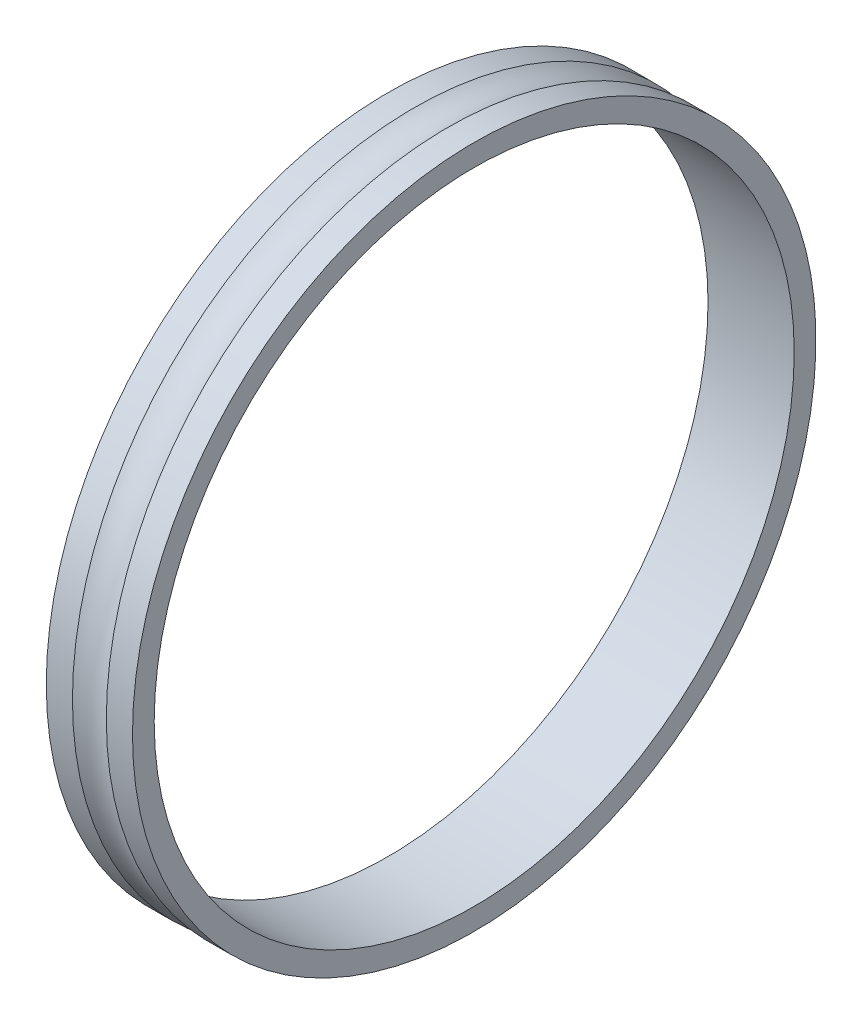
ISO-10303-21;
HEADER;
FILE_DESCRIPTION(('STEP AP214'),'2;1');
FILE_NAME('part.step','',(''),(''),'','','');
FILE_SCHEMA(('AUTOMOTIVE_DESIGN { 1 0 10303 214 1 1 1 1 }'));
ENDSEC;
DATA;
#1=APPLICATION_CONTEXT('core data for automotive mechanical design processes');
#2=APPLICATION_PROTOCOL_DEFINITION('international standard','automotive_design',2000,#1);
#3=PRODUCT_CONTEXT('',#1,'mechanical');
#4=PRODUCT('Part','Part','',(#3));
#5=PRODUCT_RELATED_PRODUCT_CATEGORY('part','',(#4));
#6=PRODUCT_DEFINITION_FORMATION('','',#4);
#7=PRODUCT_DEFINITION_CONTEXT('part definition',#1,'design');
#8=PRODUCT_DEFINITION('design','',#6,#7);
#9=PRODUCT_DEFINITION_SHAPE('','',#8);
#10=(LENGTH_UNIT() NAMED_UNIT(*) SI_UNIT(.MILLI.,.METRE.));
#11=(NAMED_UNIT(*) PLANE_ANGLE_UNIT() SI_UNIT($,.RADIAN.));
#12=(NAMED_UNIT(*) SI_UNIT($,.STERADIAN.) SOLID_ANGLE_UNIT());
#13=UNCERTAINTY_MEASURE_WITH_UNIT(LENGTH_MEASURE(1.E-05),#10,'distance_accuracy_value','');
#14=(GEOMETRIC_REPRESENTATION_CONTEXT(3) GLOBAL_UNCERTAINTY_ASSIGNED_CONTEXT((#13)) GLOBAL_UNIT_ASSIGNED_CONTEXT((#10,
#11,#12)) REPRESENTATION_CONTEXT('',''));
#15=CARTESIAN_POINT('',(0.,0.,0.));
#16=DIRECTION('',(0.,0.,1.));
#17=DIRECTION('',(1.,0.,0.));
#18=AXIS2_PLACEMENT_3D('',#15,#16,#17);
#19=CARTESIAN_POINT('',(64.16,0.,0.));
#20=DIRECTION('',(1.,0.,0.));
#21=DIRECTION('',(0.,0.,-1.));
#22=AXIS2_PLACEMENT_3D('',#19,#20,#21);
#23=TOROIDAL_SURFACE('',#22,69.383,7.15);
#24=CARTESIAN_POINT('',(67.2807388548227,0.,0.));
#25=DIRECTION('',(-1.,0.,0.));
#26=DIRECTION('',(0.,0.,1.));
#27=AXIS2_PLACEMENT_3D('',#24,#25,#26);
#28=CIRCLE('',#27,62.95);
#29=CARTESIAN_POINT('',(67.2807388548227,0.,62.95));
#30=VERTEX_POINT('',#29);
#31=EDGE_CURVE('E30',#30,#30,#28,.F.);
#32=ORIENTED_EDGE('',*,*,#31,.F.);
#33=EDGE_LOOP('',(#32));
#34=FACE_BOUND('',#33,.T.);
#35=CARTESIAN_POINT('',(61.0392611451773,0.,0.));
#36=DIRECTION('',(-1.,0.,0.));
#37=DIRECTION('',(0.,0.,1.));
#38=AXIS2_PLACEMENT_3D('',#35,#36,#37);
#39=CIRCLE('',#38,62.95);
#40=CARTESIAN_POINT('',(61.0392611451773,0.,62.95));
#41=VERTEX_POINT('',#40);
#42=EDGE_CURVE('E35',#41,#41,#39,.T.);
#43=ORIENTED_EDGE('',*,*,#42,.F.);
#44=EDGE_LOOP('',(#43));
#45=FACE_BOUND('',#44,.T.);
#46=ADVANCED_FACE('F14',(#34,#45),#23,.F.);
#47=CARTESIAN_POINT('',(64.16,0.,0.));
#48=DIRECTION('',(-1.,0.,0.));
#49=DIRECTION('',(0.,0.,1.));
#50=AXIS2_PLACEMENT_3D('',#47,#48,#49);
#51=CYLINDRICAL_SURFACE('',#50,62.95);
#52=CARTESIAN_POINT('',(72.1,0.,0.));
#53=DIRECTION('',(-1.,0.,0.));
#54=DIRECTION('',(0.,0.,1.));
#55=AXIS2_PLACEMENT_3D('',#52,#53,#54);
#56=CIRCLE('',#55,62.95);
#57=CARTESIAN_POINT('',(72.1,0.,62.95));
#58=VERTEX_POINT('',#57);
#59=EDGE_CURVE('E18',#58,#58,#56,.F.);
#60=ORIENTED_EDGE('',*,*,#59,.F.);
#61=EDGE_LOOP('',(#60));
#62=FACE_BOUND('',#61,.T.);
#63=ORIENTED_EDGE('',*,*,#31,.T.);
#64=EDGE_LOOP('',(#63));
#65=FACE_BOUND('',#64,.T.);
#66=ADVANCED_FACE('F46',(#62,#65),#51,.T.);
#67=CARTESIAN_POINT('',(64.16,0.,0.));
#68=DIRECTION('',(-1.,0.,0.));
#69=DIRECTION('',(0.,0.,1.));
#70=AXIS2_PLACEMENT_3D('',#67,#68,#69);
#71=CYLINDRICAL_SURFACE('',#70,62.95);
#72=ORIENTED_EDGE('',*,*,#42,.T.);
#73=EDGE_LOOP('',(#72));
#74=FACE_BOUND('',#73,.T.);
#75=CARTESIAN_POINT('',(56.22,0.,0.));
#76=DIRECTION('',(-1.,0.,0.));
#77=DIRECTION('',(0.,0.,1.));
#78=AXIS2_PLACEMENT_3D('',#75,#76,#77);
#79=CIRCLE('',#78,62.95);
#80=CARTESIAN_POINT('',(56.22,0.,62.95));
#81=VERTEX_POINT('',#80);
#82=EDGE_CURVE('E27',#81,#81,#79,.T.);
#83=ORIENTED_EDGE('',*,*,#82,.F.);
#84=EDGE_LOOP('',(#83));
#85=FACE_BOUND('',#84,.T.);
#86=ADVANCED_FACE('F54',(#74,#85),#71,.T.);
#87=CARTESIAN_POINT('',(72.1,0.,60.95));
#88=DIRECTION('',(1.,0.,0.));
#89=DIRECTION('',(0.,0.,-1.));
#90=AXIS2_PLACEMENT_3D('',#87,#88,#89);
#91=PLANE('',#90);
#92=ORIENTED_EDGE('',*,*,#59,.T.);
#93=EDGE_LOOP('',(#92));
#94=FACE_BOUND('',#93,.T.);
#95=CARTESIAN_POINT('',(72.1,0.,0.));
#96=DIRECTION('',(-1.,0.,0.));
#97=DIRECTION('',(0.,0.,1.));
#98=AXIS2_PLACEMENT_3D('',#95,#96,#97);
#99=CIRCLE('',#98,58.95);
#100=CARTESIAN_POINT('',(72.1,0.,58.95));
#101=VERTEX_POINT('',#100);
#102=EDGE_CURVE('E22',#101,#101,#99,.T.);
#103=ORIENTED_EDGE('',*,*,#102,.T.);
#104=EDGE_LOOP('',(#103));
#105=FACE_BOUND('',#104,.T.);
#106=ADVANCED_FACE('F64',(#94,#105),#91,.T.);
#107=CARTESIAN_POINT('',(56.22,0.,60.95));
#108=DIRECTION('',(-1.,0.,0.));
#109=DIRECTION('',(0.,0.,1.));
#110=AXIS2_PLACEMENT_3D('',#107,#108,#109);
#111=PLANE('',#110);
#112=CARTESIAN_POINT('',(56.22,0.,0.));
#113=DIRECTION('',(-1.,0.,0.));
#114=DIRECTION('',(0.,0.,1.));
#115=AXIS2_PLACEMENT_3D('',#112,#113,#114);
#116=CIRCLE('',#115,58.95);
#117=CARTESIAN_POINT('',(56.22,0.,58.95));
#118=VERTEX_POINT('',#117);
#119=EDGE_CURVE('E10',#118,#118,#116,.F.);
#120=ORIENTED_EDGE('',*,*,#119,.T.);
#121=EDGE_LOOP('',(#120));
#122=FACE_BOUND('',#121,.T.);
#123=ORIENTED_EDGE('',*,*,#82,.T.);
#124=EDGE_LOOP('',(#123));
#125=FACE_BOUND('',#124,.T.);
#126=ADVANCED_FACE('F58',(#122,#125),#111,.T.);
#127=CARTESIAN_POINT('',(64.16,0.,0.));
#128=DIRECTION('',(-1.,0.,0.));
#129=DIRECTION('',(0.,0.,1.));
#130=AXIS2_PLACEMENT_3D('',#127,#128,#129);
#131=CYLINDRICAL_SURFACE('',#130,58.95);
#132=ORIENTED_EDGE('',*,*,#119,.F.);
#133=EDGE_LOOP('',(#132));
#134=FACE_BOUND('',#133,.T.);
#135=ORIENTED_EDGE('',*,*,#102,.F.);
#136=EDGE_LOOP('',(#135));
#137=FACE_BOUND('',#136,.T.);
#138=ADVANCED_FACE('F56',(#134,#137),#131,.F.);
#139=CLOSED_SHELL('',(#46,#66,#86,#106,#126,#138));
#140=MANIFOLD_SOLID_BREP('B1',#139);
#141=ADVANCED_BREP_SHAPE_REPRESENTATION('',(#18,#140),#14);
#142=SHAPE_DEFINITION_REPRESENTATION(#9,#141);
ENDSEC;
END-ISO-10303-21;
